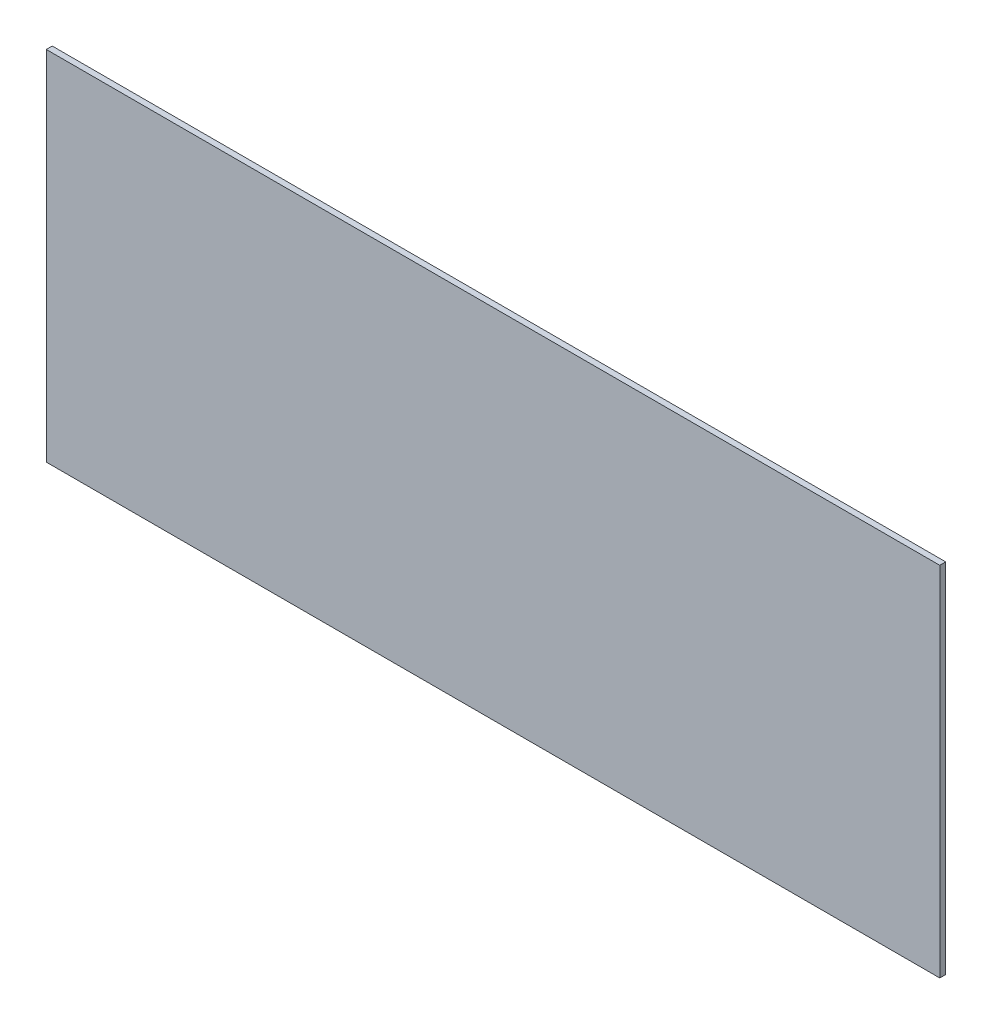
ISO-10303-21;
HEADER;
FILE_DESCRIPTION(('STEP AP214'),'2;1');
FILE_NAME('part.step','',(''),(''),'','','');
FILE_SCHEMA(('AUTOMOTIVE_DESIGN { 1 0 10303 214 1 1 1 1 }'));
ENDSEC;
DATA;
#1=APPLICATION_CONTEXT('core data for automotive mechanical design processes');
#2=APPLICATION_PROTOCOL_DEFINITION('international standard','automotive_design',2000,#1);
#3=PRODUCT_CONTEXT('',#1,'mechanical');
#4=PRODUCT('Part','Part','',(#3));
#5=PRODUCT_RELATED_PRODUCT_CATEGORY('part','',(#4));
#6=PRODUCT_DEFINITION_FORMATION('','',#4);
#7=PRODUCT_DEFINITION_CONTEXT('part definition',#1,'design');
#8=PRODUCT_DEFINITION('design','',#6,#7);
#9=PRODUCT_DEFINITION_SHAPE('','',#8);
#10=(LENGTH_UNIT() NAMED_UNIT(*) SI_UNIT(.MILLI.,.METRE.));
#11=(NAMED_UNIT(*) PLANE_ANGLE_UNIT() SI_UNIT($,.RADIAN.));
#12=(NAMED_UNIT(*) SI_UNIT($,.STERADIAN.) SOLID_ANGLE_UNIT());
#13=UNCERTAINTY_MEASURE_WITH_UNIT(LENGTH_MEASURE(1.E-05),#10,'distance_accuracy_value','');
#14=(GEOMETRIC_REPRESENTATION_CONTEXT(3) GLOBAL_UNCERTAINTY_ASSIGNED_CONTEXT((#13)) GLOBAL_UNIT_ASSIGNED_CONTEXT((#10,
#11,#12)) REPRESENTATION_CONTEXT('',''));
#15=CARTESIAN_POINT('',(0.,0.,0.));
#16=DIRECTION('',(0.,0.,1.));
#17=DIRECTION('',(1.,0.,0.));
#18=AXIS2_PLACEMENT_3D('',#15,#16,#17);
#19=CARTESIAN_POINT('',(-150.,-36.7008196721311,2.));
#20=DIRECTION('',(1.,0.,0.));
#21=DIRECTION('',(0.,0.,-1.));
#22=AXIS2_PLACEMENT_3D('',#19,#20,#21);
#23=PLANE('',#22);
#24=DIRECTION('',(0.,-1.,0.));
#25=VECTOR('',#24,1.);
#26=CARTESIAN_POINT('',(-150.,-36.7008196721311,0.));
#27=LINE('',#26,#25);
#28=CARTESIAN_POINT('',(-150.,83.2991803278689,0.));
#29=VERTEX_POINT('',#28);
#30=CARTESIAN_POINT('',(-150.,-36.7008196721311,0.));
#31=VERTEX_POINT('',#30);
#32=EDGE_CURVE('E95',#29,#31,#27,.T.);
#33=ORIENTED_EDGE('',*,*,#32,.T.);
#34=DIRECTION('',(0.,0.,-1.));
#35=VECTOR('',#34,1.);
#36=CARTESIAN_POINT('',(-150.,-36.7008196721311,2.));
#37=LINE('',#36,#35);
#38=CARTESIAN_POINT('',(-150.,-36.7008196721311,2.));
#39=VERTEX_POINT('',#38);
#40=EDGE_CURVE('E11',#39,#31,#37,.T.);
#41=ORIENTED_EDGE('',*,*,#40,.F.);
#42=DIRECTION('',(0.,-1.,0.));
#43=VECTOR('',#42,1.);
#44=CARTESIAN_POINT('',(-150.,-36.7008196721311,2.));
#45=LINE('',#44,#43);
#46=CARTESIAN_POINT('',(-150.,83.2991803278689,2.));
#47=VERTEX_POINT('',#46);
#48=EDGE_CURVE('E83',#47,#39,#45,.T.);
#49=ORIENTED_EDGE('',*,*,#48,.F.);
#50=DIRECTION('',(0.,0.,-1.));
#51=VECTOR('',#50,1.);
#52=CARTESIAN_POINT('',(-150.,83.2991803278689,2.));
#53=LINE('',#52,#51);
#54=EDGE_CURVE('E91',#47,#29,#53,.T.);
#55=ORIENTED_EDGE('',*,*,#54,.T.);
#56=EDGE_LOOP('',(#33,#41,#49,#55));
#57=FACE_BOUND('',#56,.T.);
#58=ADVANCED_FACE('F32',(#57),#23,.F.);
#59=CARTESIAN_POINT('',(150.,-36.7008196721311,2.));
#60=DIRECTION('',(0.,1.,0.));
#61=DIRECTION('',(-1.,0.,0.));
#62=AXIS2_PLACEMENT_3D('',#59,#60,#61);
#63=PLANE('',#62);
#64=DIRECTION('',(1.,0.,0.));
#65=VECTOR('',#64,1.);
#66=CARTESIAN_POINT('',(150.,-36.7008196721311,0.));
#67=LINE('',#66,#65);
#68=CARTESIAN_POINT('',(150.,-36.7008196721311,0.));
#69=VERTEX_POINT('',#68);
#70=EDGE_CURVE('E87',#31,#69,#67,.T.);
#71=ORIENTED_EDGE('',*,*,#70,.T.);
#72=DIRECTION('',(0.,0.,-1.));
#73=VECTOR('',#72,1.);
#74=CARTESIAN_POINT('',(150.,-36.7008196721311,2.));
#75=LINE('',#74,#73);
#76=CARTESIAN_POINT('',(150.,-36.7008196721311,2.));
#77=VERTEX_POINT('',#76);
#78=EDGE_CURVE('E40',#77,#69,#75,.T.);
#79=ORIENTED_EDGE('',*,*,#78,.F.);
#80=DIRECTION('',(1.,0.,0.));
#81=VECTOR('',#80,1.);
#82=CARTESIAN_POINT('',(150.,-36.7008196721311,2.));
#83=LINE('',#82,#81);
#84=EDGE_CURVE('E78',#39,#77,#83,.T.);
#85=ORIENTED_EDGE('',*,*,#84,.F.);
#86=ORIENTED_EDGE('',*,*,#40,.T.);
#87=EDGE_LOOP('',(#71,#79,#85,#86));
#88=FACE_BOUND('',#87,.T.);
#89=ADVANCED_FACE('F86',(#88),#63,.F.);
#90=CARTESIAN_POINT('',(150.,-36.7008196721311,2.));
#91=DIRECTION('',(-1.,0.,0.));
#92=DIRECTION('',(0.,0.,1.));
#93=AXIS2_PLACEMENT_3D('',#90,#91,#92);
#94=PLANE('',#93);
#95=DIRECTION('',(0.,1.,0.));
#96=VECTOR('',#95,1.);
#97=CARTESIAN_POINT('',(150.,-36.7008196721311,0.));
#98=LINE('',#97,#96);
#99=CARTESIAN_POINT('',(150.,83.2991803278689,0.));
#100=VERTEX_POINT('',#99);
#101=EDGE_CURVE('E65',#69,#100,#98,.T.);
#102=ORIENTED_EDGE('',*,*,#101,.T.);
#103=DIRECTION('',(0.,0.,-1.));
#104=VECTOR('',#103,1.);
#105=CARTESIAN_POINT('',(150.,83.2991803278689,2.));
#106=LINE('',#105,#104);
#107=CARTESIAN_POINT('',(150.,83.2991803278689,2.));
#108=VERTEX_POINT('',#107);
#109=EDGE_CURVE('E88',#108,#100,#106,.T.);
#110=ORIENTED_EDGE('',*,*,#109,.F.);
#111=DIRECTION('',(0.,1.,0.));
#112=VECTOR('',#111,1.);
#113=CARTESIAN_POINT('',(150.,-36.7008196721311,2.));
#114=LINE('',#113,#112);
#115=EDGE_CURVE('E81',#77,#108,#114,.T.);
#116=ORIENTED_EDGE('',*,*,#115,.F.);
#117=ORIENTED_EDGE('',*,*,#78,.T.);
#118=EDGE_LOOP('',(#102,#110,#116,#117));
#119=FACE_BOUND('',#118,.T.);
#120=ADVANCED_FACE('F89',(#119),#94,.F.);
#121=CARTESIAN_POINT('',(150.,83.2991803278689,2.));
#122=DIRECTION('',(0.,-1.,0.));
#123=DIRECTION('',(0.,0.,-1.));
#124=AXIS2_PLACEMENT_3D('',#121,#122,#123);
#125=PLANE('',#124);
#126=DIRECTION('',(-1.,0.,0.));
#127=VECTOR('',#126,1.);
#128=CARTESIAN_POINT('',(150.,83.2991803278689,0.));
#129=LINE('',#128,#127);
#130=EDGE_CURVE('E71',#100,#29,#129,.T.);
#131=ORIENTED_EDGE('',*,*,#130,.T.);
#132=ORIENTED_EDGE('',*,*,#54,.F.);
#133=DIRECTION('',(-1.,0.,0.));
#134=VECTOR('',#133,1.);
#135=CARTESIAN_POINT('',(150.,83.2991803278689,2.));
#136=LINE('',#135,#134);
#137=EDGE_CURVE('E48',#108,#47,#136,.T.);
#138=ORIENTED_EDGE('',*,*,#137,.F.);
#139=ORIENTED_EDGE('',*,*,#109,.T.);
#140=EDGE_LOOP('',(#131,#132,#138,#139));
#141=FACE_BOUND('',#140,.T.);
#142=ADVANCED_FACE('F102',(#141),#125,.F.);
#143=CARTESIAN_POINT('',(0.,0.,2.));
#144=DIRECTION('',(0.,0.,1.));
#145=DIRECTION('',(1.,0.,0.));
#146=AXIS2_PLACEMENT_3D('',#143,#144,#145);
#147=PLANE('',#146);
#148=ORIENTED_EDGE('',*,*,#48,.T.);
#149=ORIENTED_EDGE('',*,*,#84,.T.);
#150=ORIENTED_EDGE('',*,*,#115,.T.);
#151=ORIENTED_EDGE('',*,*,#137,.T.);
#152=EDGE_LOOP('',(#148,#149,#150,#151));
#153=FACE_BOUND('',#152,.T.);
#154=ADVANCED_FACE('F79',(#153),#147,.T.);
#155=CARTESIAN_POINT('',(0.,0.,0.));
#156=DIRECTION('',(0.,0.,1.));
#157=DIRECTION('',(1.,0.,0.));
#158=AXIS2_PLACEMENT_3D('',#155,#156,#157);
#159=PLANE('',#158);
#160=ORIENTED_EDGE('',*,*,#32,.F.);
#161=ORIENTED_EDGE('',*,*,#130,.F.);
#162=ORIENTED_EDGE('',*,*,#101,.F.);
#163=ORIENTED_EDGE('',*,*,#70,.F.);
#164=EDGE_LOOP('',(#160,#161,#162,#163));
#165=FACE_BOUND('',#164,.T.);
#166=ADVANCED_FACE('F105',(#165),#159,.F.);
#167=CLOSED_SHELL('',(#58,#89,#120,#142,#154,#166));
#168=MANIFOLD_SOLID_BREP('B2',#167);
#169=ADVANCED_BREP_SHAPE_REPRESENTATION('',(#18,#168),#14);
#170=SHAPE_DEFINITION_REPRESENTATION(#9,#169);
ENDSEC;
END-ISO-10303-21;
